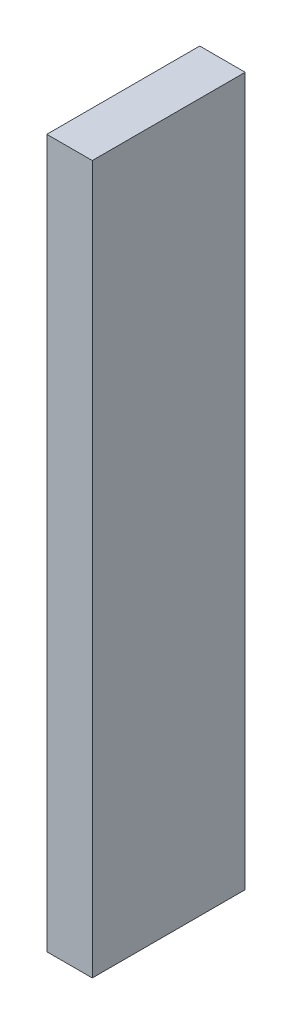
ISO-10303-21;
HEADER;
FILE_DESCRIPTION(('STEP AP214'),'2;1');
FILE_NAME('part.step','',(''),(''),'','','');
FILE_SCHEMA(('AUTOMOTIVE_DESIGN { 1 0 10303 214 1 1 1 1 }'));
ENDSEC;
DATA;
#1=APPLICATION_CONTEXT('core data for automotive mechanical design processes');
#2=APPLICATION_PROTOCOL_DEFINITION('international standard','automotive_design',2000,#1);
#3=PRODUCT_CONTEXT('',#1,'mechanical');
#4=PRODUCT('Part','Part','',(#3));
#5=PRODUCT_RELATED_PRODUCT_CATEGORY('part','',(#4));
#6=PRODUCT_DEFINITION_FORMATION('','',#4);
#7=PRODUCT_DEFINITION_CONTEXT('part definition',#1,'design');
#8=PRODUCT_DEFINITION('design','',#6,#7);
#9=PRODUCT_DEFINITION_SHAPE('','',#8);
#10=(LENGTH_UNIT() NAMED_UNIT(*) SI_UNIT(.MILLI.,.METRE.));
#11=(NAMED_UNIT(*) PLANE_ANGLE_UNIT() SI_UNIT($,.RADIAN.));
#12=(NAMED_UNIT(*) SI_UNIT($,.STERADIAN.) SOLID_ANGLE_UNIT());
#13=UNCERTAINTY_MEASURE_WITH_UNIT(LENGTH_MEASURE(1.E-05),#10,'distance_accuracy_value','');
#14=(GEOMETRIC_REPRESENTATION_CONTEXT(3) GLOBAL_UNCERTAINTY_ASSIGNED_CONTEXT((#13)) GLOBAL_UNIT_ASSIGNED_CONTEXT((#10,
#11,#12)) REPRESENTATION_CONTEXT('',''));
#15=CARTESIAN_POINT('',(0.,0.,0.));
#16=DIRECTION('',(0.,0.,1.));
#17=DIRECTION('',(1.,0.,0.));
#18=AXIS2_PLACEMENT_3D('',#15,#16,#17);
#19=CARTESIAN_POINT('',(130.275545263252,22.4180708263693,56.0720282028969));
#20=DIRECTION('',(-1.69244514382854E-09,0.,1.));
#21=DIRECTION('',(1.,0.,1.69244514382854E-09));
#22=AXIS2_PLACEMENT_3D('',#19,#20,#21);
#23=PLANE('',#22);
#24=DIRECTION('',(0.,-1.,0.));
#25=VECTOR('',#24,1.);
#26=CARTESIAN_POINT('',(131.258630360265,22.4180708263693,56.0720282045608));
#27=LINE('',#26,#25);
#28=CARTESIAN_POINT('',(131.258630360265,22.4180708263693,56.0720282045608));
#29=VERTEX_POINT('',#28);
#30=CARTESIAN_POINT('',(131.258630360265,7.11212965552236,56.0720282045607));
#31=VERTEX_POINT('',#30);
#32=EDGE_CURVE('E79',#29,#31,#27,.T.);
#33=ORIENTED_EDGE('',*,*,#32,.F.);
#34=DIRECTION('',(1.,0.,1.69244514382854E-09));
#35=VECTOR('',#34,1.);
#36=CARTESIAN_POINT('',(130.275545263252,22.4180708263693,56.0720282028969));
#37=LINE('',#36,#35);
#38=CARTESIAN_POINT('',(130.275545263252,22.4180708263693,56.0720282028969));
#39=VERTEX_POINT('',#38);
#40=EDGE_CURVE('E32',#39,#29,#37,.T.);
#41=ORIENTED_EDGE('',*,*,#40,.F.);
#42=DIRECTION('',(0.,-1.,0.));
#43=VECTOR('',#42,1.);
#44=CARTESIAN_POINT('',(130.275545263252,22.4180708263693,56.0720282028969));
#45=LINE('',#44,#43);
#46=CARTESIAN_POINT('',(130.275545263252,7.11212965552236,56.0720282028969));
#47=VERTEX_POINT('',#46);
#48=EDGE_CURVE('E71',#39,#47,#45,.T.);
#49=ORIENTED_EDGE('',*,*,#48,.T.);
#50=DIRECTION('',(1.,0.,1.69244514382854E-09));
#51=VECTOR('',#50,1.);
#52=CARTESIAN_POINT('',(130.275545263252,7.11212965552236,56.0720282028969));
#53=LINE('',#52,#51);
#54=EDGE_CURVE('E10',#47,#31,#53,.T.);
#55=ORIENTED_EDGE('',*,*,#54,.T.);
#56=EDGE_LOOP('',(#33,#41,#49,#55));
#57=FACE_BOUND('',#56,.T.);
#58=ADVANCED_FACE('F16',(#57),#23,.T.);
#59=CARTESIAN_POINT('',(130.275545263252,7.11212965552236,56.0720282028969));
#60=DIRECTION('',(0.,-1.,0.));
#61=DIRECTION('',(0.,0.,-1.));
#62=AXIS2_PLACEMENT_3D('',#59,#60,#61);
#63=PLANE('',#62);
#64=DIRECTION('',(1.69244514382854E-09,0.,-1.));
#65=VECTOR('',#64,1.);
#66=CARTESIAN_POINT('',(131.258630360265,7.11212965552236,56.0720282045607));
#67=LINE('',#66,#65);
#68=CARTESIAN_POINT('',(131.25863036586,7.11212965552235,52.766087033712));
#69=VERTEX_POINT('',#68);
#70=EDGE_CURVE('E82',#31,#69,#67,.T.);
#71=ORIENTED_EDGE('',*,*,#70,.F.);
#72=ORIENTED_EDGE('',*,*,#54,.F.);
#73=DIRECTION('',(1.69244514382854E-09,0.,-1.));
#74=VECTOR('',#73,1.);
#75=CARTESIAN_POINT('',(130.275545263252,7.11212965552236,56.0720282028969));
#76=LINE('',#75,#74);
#77=CARTESIAN_POINT('',(130.275545268847,7.11212965552235,52.7660870320482));
#78=VERTEX_POINT('',#77);
#79=EDGE_CURVE('E67',#47,#78,#76,.T.);
#80=ORIENTED_EDGE('',*,*,#79,.T.);
#81=DIRECTION('',(1.,0.,1.69244514382854E-09));
#82=VECTOR('',#81,1.);
#83=CARTESIAN_POINT('',(130.275545268847,7.11212965552235,52.7660870320482));
#84=LINE('',#83,#82);
#85=EDGE_CURVE('E24',#78,#69,#84,.T.);
#86=ORIENTED_EDGE('',*,*,#85,.T.);
#87=EDGE_LOOP('',(#71,#72,#80,#86));
#88=FACE_BOUND('',#87,.T.);
#89=ADVANCED_FACE('F68',(#88),#63,.T.);
#90=CARTESIAN_POINT('',(130.275545268847,7.11212965552235,52.7660870320482));
#91=DIRECTION('',(1.69244514382854E-09,0.,-1.));
#92=DIRECTION('',(-1.,0.,-1.69244514382854E-09));
#93=AXIS2_PLACEMENT_3D('',#90,#91,#92);
#94=PLANE('',#93);
#95=DIRECTION('',(0.,1.,0.));
#96=VECTOR('',#95,1.);
#97=CARTESIAN_POINT('',(131.25863036586,7.11212965552235,52.766087033712));
#98=LINE('',#97,#96);
#99=CARTESIAN_POINT('',(131.25863036586,22.418070826371,52.7660870252515));
#100=VERTEX_POINT('',#99);
#101=EDGE_CURVE('E65',#69,#100,#98,.T.);
#102=ORIENTED_EDGE('',*,*,#101,.F.);
#103=ORIENTED_EDGE('',*,*,#85,.F.);
#104=DIRECTION('',(0.,1.,0.));
#105=VECTOR('',#104,1.);
#106=CARTESIAN_POINT('',(130.275545268847,7.11212965552235,52.7660870320482));
#107=LINE('',#106,#105);
#108=CARTESIAN_POINT('',(130.275545268847,22.418070826371,52.7660870235876));
#109=VERTEX_POINT('',#108);
#110=EDGE_CURVE('E62',#78,#109,#107,.T.);
#111=ORIENTED_EDGE('',*,*,#110,.T.);
#112=DIRECTION('',(1.,0.,1.69244514382854E-09));
#113=VECTOR('',#112,1.);
#114=CARTESIAN_POINT('',(130.275545268847,22.418070826371,52.7660870235876));
#115=LINE('',#114,#113);
#116=EDGE_CURVE('E48',#109,#100,#115,.T.);
#117=ORIENTED_EDGE('',*,*,#116,.T.);
#118=EDGE_LOOP('',(#102,#103,#111,#117));
#119=FACE_BOUND('',#118,.T.);
#120=ADVANCED_FACE('F60',(#119),#94,.T.);
#121=CARTESIAN_POINT('',(130.275545268847,22.418070826371,52.7660870235876));
#122=DIRECTION('',(0.,1.,0.));
#123=DIRECTION('',(-1.,0.,0.));
#124=AXIS2_PLACEMENT_3D('',#121,#122,#123);
#125=PLANE('',#124);
#126=DIRECTION('',(-1.69244514382854E-09,0.,1.));
#127=VECTOR('',#126,1.);
#128=CARTESIAN_POINT('',(131.25863036586,22.418070826371,52.7660870252515));
#129=LINE('',#128,#127);
#130=EDGE_CURVE('E85',#100,#29,#129,.T.);
#131=ORIENTED_EDGE('',*,*,#130,.F.);
#132=ORIENTED_EDGE('',*,*,#116,.F.);
#133=DIRECTION('',(-1.69244514382854E-09,0.,1.));
#134=VECTOR('',#133,1.);
#135=CARTESIAN_POINT('',(130.275545268847,22.418070826371,52.7660870235876));
#136=LINE('',#135,#134);
#137=EDGE_CURVE('E74',#109,#39,#136,.T.);
#138=ORIENTED_EDGE('',*,*,#137,.T.);
#139=ORIENTED_EDGE('',*,*,#40,.T.);
#140=EDGE_LOOP('',(#131,#132,#138,#139));
#141=FACE_BOUND('',#140,.T.);
#142=ADVANCED_FACE('F96',(#141),#125,.T.);
#143=CARTESIAN_POINT('',(130.275545201028,17.2651002409467,92.8378644340291));
#144=DIRECTION('',(1.,0.,1.69244514382854E-09));
#145=DIRECTION('',(0.,1.,0.));
#146=AXIS2_PLACEMENT_3D('',#143,#144,#145);
#147=PLANE('',#146);
#148=ORIENTED_EDGE('',*,*,#48,.F.);
#149=ORIENTED_EDGE('',*,*,#137,.F.);
#150=ORIENTED_EDGE('',*,*,#110,.F.);
#151=ORIENTED_EDGE('',*,*,#79,.F.);
#152=EDGE_LOOP('',(#148,#149,#150,#151));
#153=FACE_BOUND('',#152,.T.);
#154=ADVANCED_FACE('F73',(#153),#147,.F.);
#155=CARTESIAN_POINT('',(131.258630298041,17.2651002409467,92.8378644356929));
#156=DIRECTION('',(1.,0.,1.69244514382854E-09));
#157=DIRECTION('',(0.,1.,0.));
#158=AXIS2_PLACEMENT_3D('',#155,#156,#157);
#159=PLANE('',#158);
#160=ORIENTED_EDGE('',*,*,#32,.T.);
#161=ORIENTED_EDGE('',*,*,#70,.T.);
#162=ORIENTED_EDGE('',*,*,#101,.T.);
#163=ORIENTED_EDGE('',*,*,#130,.T.);
#164=EDGE_LOOP('',(#160,#161,#162,#163));
#165=FACE_BOUND('',#164,.T.);
#166=ADVANCED_FACE('F89',(#165),#159,.T.);
#167=CLOSED_SHELL('',(#58,#89,#120,#142,#154,#166));
#168=MANIFOLD_SOLID_BREP('B1',#167);
#169=ADVANCED_BREP_SHAPE_REPRESENTATION('',(#18,#168),#14);
#170=SHAPE_DEFINITION_REPRESENTATION(#9,#169);
ENDSEC;
END-ISO-10303-21;
